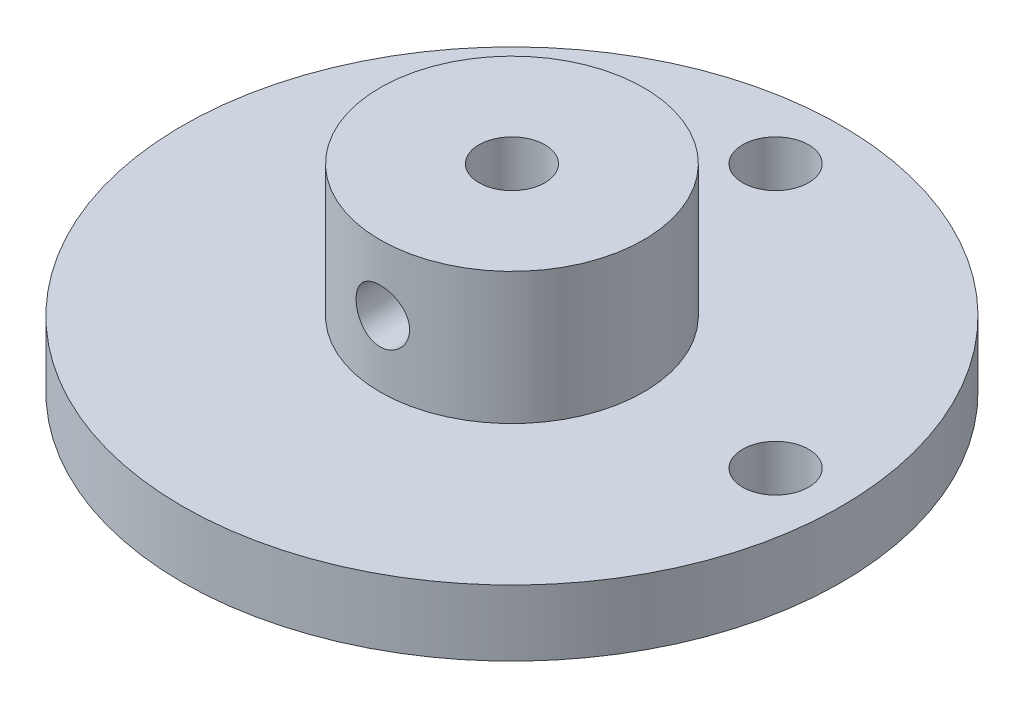
ISO-10303-21;
HEADER;
FILE_DESCRIPTION(('STEP AP214'),'2;1');
FILE_NAME('part.step','',(''),(''),'','','');
FILE_SCHEMA(('AUTOMOTIVE_DESIGN { 1 0 10303 214 1 1 1 1 }'));
ENDSEC;
DATA;
#1=APPLICATION_CONTEXT('core data for automotive mechanical design processes');
#2=APPLICATION_PROTOCOL_DEFINITION('international standard','automotive_design',2000,#1);
#3=PRODUCT_CONTEXT('',#1,'mechanical');
#4=PRODUCT('Part','Part','',(#3));
#5=PRODUCT_RELATED_PRODUCT_CATEGORY('part','',(#4));
#6=PRODUCT_DEFINITION_FORMATION('','',#4);
#7=PRODUCT_DEFINITION_CONTEXT('part definition',#1,'design');
#8=PRODUCT_DEFINITION('design','',#6,#7);
#9=PRODUCT_DEFINITION_SHAPE('','',#8);
#10=(LENGTH_UNIT() NAMED_UNIT(*) SI_UNIT(.MILLI.,.METRE.));
#11=(NAMED_UNIT(*) PLANE_ANGLE_UNIT() SI_UNIT($,.RADIAN.));
#12=(NAMED_UNIT(*) SI_UNIT($,.STERADIAN.) SOLID_ANGLE_UNIT());
#13=UNCERTAINTY_MEASURE_WITH_UNIT(LENGTH_MEASURE(1.E-05),#10,'distance_accuracy_value','');
#14=(GEOMETRIC_REPRESENTATION_CONTEXT(3) GLOBAL_UNCERTAINTY_ASSIGNED_CONTEXT((#13)) GLOBAL_UNIT_ASSIGNED_CONTEXT((#10,
#11,#12)) REPRESENTATION_CONTEXT('',''));
#15=CARTESIAN_POINT('',(0.,0.,0.));
#16=DIRECTION('',(0.,0.,1.));
#17=DIRECTION('',(1.,0.,0.));
#18=AXIS2_PLACEMENT_3D('',#15,#16,#17);
#19=CARTESIAN_POINT('',(0.,3.175,0.));
#20=DIRECTION('',(0.,1.,0.));
#21=DIRECTION('',(0.,0.,1.));
#22=AXIS2_PLACEMENT_3D('',#19,#20,#21);
#23=PLANE('',#22);
#24=CARTESIAN_POINT('',(12.7,3.175,0.));
#25=DIRECTION('',(0.,1.,0.));
#26=DIRECTION('',(0.,0.,1.));
#27=AXIS2_PLACEMENT_3D('',#24,#25,#26);
#28=CIRCLE('',#27,1.5875);
#29=CARTESIAN_POINT('',(12.7,3.175,1.58750000000001));
#30=VERTEX_POINT('',#29);
#31=EDGE_CURVE('E57',#30,#30,#28,.T.);
#32=ORIENTED_EDGE('',*,*,#31,.F.);
#33=EDGE_LOOP('',(#32));
#34=FACE_BOUND('',#33,.T.);
#35=CARTESIAN_POINT('',(0.,3.175,0.));
#36=DIRECTION('',(0.,1.,0.));
#37=DIRECTION('',(0.,0.,1.));
#38=AXIS2_PLACEMENT_3D('',#35,#36,#37);
#39=CIRCLE('',#38,15.875);
#40=CARTESIAN_POINT('',(0.,3.175,15.875));
#41=VERTEX_POINT('',#40);
#42=EDGE_CURVE('E10',#41,#41,#39,.T.);
#43=ORIENTED_EDGE('',*,*,#42,.T.);
#44=EDGE_LOOP('',(#43));
#45=FACE_BOUND('',#44,.T.);
#46=CARTESIAN_POINT('',(0.,3.175,-12.7));
#47=DIRECTION('',(0.,1.,0.));
#48=DIRECTION('',(0.,0.,1.));
#49=AXIS2_PLACEMENT_3D('',#46,#47,#48);
#50=CIRCLE('',#49,1.5875);
#51=CARTESIAN_POINT('',(0.,3.175,-11.1125));
#52=VERTEX_POINT('',#51);
#53=EDGE_CURVE('E52',#52,#52,#50,.T.);
#54=ORIENTED_EDGE('',*,*,#53,.F.);
#55=EDGE_LOOP('',(#54));
#56=FACE_BOUND('',#55,.T.);
#57=CARTESIAN_POINT('',(0.,3.175,0.));
#58=DIRECTION('',(0.,1.,0.));
#59=DIRECTION('',(0.,0.,1.));
#60=AXIS2_PLACEMENT_3D('',#57,#58,#59);
#61=CIRCLE('',#60,6.35);
#62=CARTESIAN_POINT('',(0.,3.175,6.35));
#63=VERTEX_POINT('',#62);
#64=EDGE_CURVE('E66',#63,#63,#61,.T.);
#65=ORIENTED_EDGE('',*,*,#64,.F.);
#66=EDGE_LOOP('',(#65));
#67=FACE_BOUND('',#66,.T.);
#68=ADVANCED_FACE('F35',(#34,#45,#56,#67),#23,.T.);
#69=CARTESIAN_POINT('',(0.,0.,0.));
#70=DIRECTION('',(0.,1.,0.));
#71=DIRECTION('',(0.,0.,1.));
#72=AXIS2_PLACEMENT_3D('',#69,#70,#71);
#73=PLANE('',#72);
#74=CARTESIAN_POINT('',(0.,0.,0.));
#75=DIRECTION('',(0.,1.,0.));
#76=DIRECTION('',(0.,0.,1.));
#77=AXIS2_PLACEMENT_3D('',#74,#75,#76);
#78=CIRCLE('',#77,1.5875);
#79=CARTESIAN_POINT('',(0.,0.,1.5875));
#80=VERTEX_POINT('',#79);
#81=EDGE_CURVE('E69',#80,#80,#78,.T.);
#82=ORIENTED_EDGE('',*,*,#81,.T.);
#83=EDGE_LOOP('',(#82));
#84=FACE_BOUND('',#83,.T.);
#85=CARTESIAN_POINT('',(0.,0.,-12.7));
#86=DIRECTION('',(0.,1.,0.));
#87=DIRECTION('',(0.,0.,1.));
#88=AXIS2_PLACEMENT_3D('',#85,#86,#87);
#89=CIRCLE('',#88,1.5875);
#90=CARTESIAN_POINT('',(0.,0.,-11.1125));
#91=VERTEX_POINT('',#90);
#92=EDGE_CURVE('E54',#91,#91,#89,.T.);
#93=ORIENTED_EDGE('',*,*,#92,.T.);
#94=EDGE_LOOP('',(#93));
#95=FACE_BOUND('',#94,.T.);
#96=CARTESIAN_POINT('',(0.,0.,0.));
#97=DIRECTION('',(0.,1.,0.));
#98=DIRECTION('',(0.,0.,1.));
#99=AXIS2_PLACEMENT_3D('',#96,#97,#98);
#100=CIRCLE('',#99,15.875);
#101=CARTESIAN_POINT('',(0.,0.,15.875));
#102=VERTEX_POINT('',#101);
#103=EDGE_CURVE('E47',#102,#102,#100,.T.);
#104=ORIENTED_EDGE('',*,*,#103,.F.);
#105=EDGE_LOOP('',(#104));
#106=FACE_BOUND('',#105,.T.);
#107=CARTESIAN_POINT('',(12.7,0.,0.));
#108=DIRECTION('',(0.,1.,0.));
#109=DIRECTION('',(0.,0.,1.));
#110=AXIS2_PLACEMENT_3D('',#107,#108,#109);
#111=CIRCLE('',#110,1.5875);
#112=CARTESIAN_POINT('',(12.7,0.,1.58750000000001));
#113=VERTEX_POINT('',#112);
#114=EDGE_CURVE('E60',#113,#113,#111,.T.);
#115=ORIENTED_EDGE('',*,*,#114,.T.);
#116=EDGE_LOOP('',(#115));
#117=FACE_BOUND('',#116,.T.);
#118=ADVANCED_FACE('F108',(#84,#95,#106,#117),#73,.F.);
#119=CARTESIAN_POINT('',(0.,3.175,0.));
#120=DIRECTION('',(0.,-1.,0.));
#121=DIRECTION('',(0.,0.,-1.));
#122=AXIS2_PLACEMENT_3D('',#119,#120,#121);
#123=CYLINDRICAL_SURFACE('',#122,15.875);
#124=ORIENTED_EDGE('',*,*,#42,.F.);
#125=EDGE_LOOP('',(#124));
#126=FACE_BOUND('',#125,.T.);
#127=ORIENTED_EDGE('',*,*,#103,.T.);
#128=EDGE_LOOP('',(#127));
#129=FACE_BOUND('',#128,.T.);
#130=ADVANCED_FACE('F37',(#126,#129),#123,.T.);
#131=CARTESIAN_POINT('',(0.,3.175,-12.7));
#132=DIRECTION('',(0.,-1.,0.));
#133=DIRECTION('',(0.,0.,-1.));
#134=AXIS2_PLACEMENT_3D('',#131,#132,#133);
#135=CYLINDRICAL_SURFACE('',#134,1.5875);
#136=ORIENTED_EDGE('',*,*,#53,.T.);
#137=EDGE_LOOP('',(#136));
#138=FACE_BOUND('',#137,.T.);
#139=ORIENTED_EDGE('',*,*,#92,.F.);
#140=EDGE_LOOP('',(#139));
#141=FACE_BOUND('',#140,.T.);
#142=ADVANCED_FACE('F117',(#138,#141),#135,.F.);
#143=CARTESIAN_POINT('',(12.7,3.175,0.));
#144=DIRECTION('',(0.,-1.,0.));
#145=DIRECTION('',(0.,0.,-1.));
#146=AXIS2_PLACEMENT_3D('',#143,#144,#145);
#147=CYLINDRICAL_SURFACE('',#146,1.5875);
#148=ORIENTED_EDGE('',*,*,#31,.T.);
#149=EDGE_LOOP('',(#148));
#150=FACE_BOUND('',#149,.T.);
#151=ORIENTED_EDGE('',*,*,#114,.F.);
#152=EDGE_LOOP('',(#151));
#153=FACE_BOUND('',#152,.T.);
#154=ADVANCED_FACE('F103',(#150,#153),#147,.F.);
#155=CARTESIAN_POINT('',(0.,9.525,0.));
#156=DIRECTION('',(0.,-1.,0.));
#157=DIRECTION('',(0.,0.,-1.));
#158=AXIS2_PLACEMENT_3D('',#155,#156,#157);
#159=CYLINDRICAL_SURFACE('',#158,6.35);
#160=CARTESIAN_POINT('',(-1.28905,6.35,6.21778498321549));
#161=CARTESIAN_POINT('',(-1.28904737952194,6.42160150366187,6.21778641339051));
#162=CARTESIAN_POINT('',(-1.2830639736923,6.49323577273111,6.21903523507547));
#163=CARTESIAN_POINT('',(-1.25930934791696,6.63447617922766,6.22388796989815));
#164=CARTESIAN_POINT('',(-1.24152883687684,6.70408067291346,6.22749373927363));
#165=CARTESIAN_POINT('',(-1.19475544617143,6.83919775621384,6.23663554841667));
#166=CARTESIAN_POINT('',(-1.16577389567251,6.90471440291829,6.24216963725208));
#167=CARTESIAN_POINT('',(-1.09745234847629,7.02995420754309,6.25454220903173));
#168=CARTESIAN_POINT('',(-1.05811287303627,7.08967765679624,6.26138062633154));
#169=CARTESIAN_POINT('',(-0.969581389966977,7.20250840099399,6.27570261385446));
#170=CARTESIAN_POINT('',(-0.92026734301716,7.25551903270124,6.28319344736122));
#171=CARTESIAN_POINT('',(-0.813450203849385,7.35257506292211,6.29791236529199));
#172=CARTESIAN_POINT('',(-0.75594652874443,7.39661982275799,6.3051404309678));
#173=CARTESIAN_POINT('',(-0.633741096747164,7.47487006146509,6.31859786240251));
#174=CARTESIAN_POINT('',(-0.568979266759275,7.50898350860826,6.324817663883));
#175=CARTESIAN_POINT('',(-0.4344955757306,7.56580866140436,6.33547610217282));
#176=CARTESIAN_POINT('',(-0.364774193881214,7.58852146688239,6.33991491078706));
#177=CARTESIAN_POINT('',(-0.223354008587394,7.6215992097972,6.34645991444234));
#178=CARTESIAN_POINT('',(-0.151694847740931,7.63212743484754,6.34859692859883));
#179=CARTESIAN_POINT('',(-0.00759761190573583,7.64104677660912,6.35040405229694));
#180=CARTESIAN_POINT('',(0.0648403851417759,7.63943909672472,6.35007440643423));
#181=CARTESIAN_POINT('',(0.207316450153965,7.62425576747759,6.34700918271445));
#182=CARTESIAN_POINT('',(0.277374135506261,7.6108560223873,6.34430896844471));
#183=CARTESIAN_POINT('',(0.41422543435876,7.57274814193144,6.33684594882567));
#184=CARTESIAN_POINT('',(0.481018914371296,7.5480395445249,6.33208305920294));
#185=CARTESIAN_POINT('',(0.609945506489828,7.48785353073555,6.32097178391367));
#186=CARTESIAN_POINT('',(0.67204570801619,7.45230754636443,6.31461334995907));
#187=CARTESIAN_POINT('',(0.789464875766029,7.37150657539758,6.30101135974161));
#188=CARTESIAN_POINT('',(0.844783038079518,7.32625043955277,6.29376769875106));
#189=CARTESIAN_POINT('',(0.948112119092833,7.22634994311278,6.27904137464542));
#190=CARTESIAN_POINT('',(0.995974032761278,7.17155163185794,6.27155675540496));
#191=CARTESIAN_POINT('',(1.08185362947766,7.05463047262196,6.2573151893891));
#192=CARTESIAN_POINT('',(1.11987111490792,6.99250747764107,6.25055825722294));
#193=CARTESIAN_POINT('',(1.18503633146353,6.86248226100736,6.23853305055112));
#194=CARTESIAN_POINT('',(1.212159320607,6.79456730448624,6.23326817246877));
#195=CARTESIAN_POINT('',(1.25456521573853,6.65501235921529,6.22487254247456));
#196=CARTESIAN_POINT('',(1.26984971580651,6.58337287336872,6.22174150324318));
#197=CARTESIAN_POINT('',(1.28792076915166,6.43975465044125,6.21802578311351));
#198=CARTESIAN_POINT('',(1.29092277358367,6.36780412831669,6.21739721099666));
#199=CARTESIAN_POINT('',(1.28492392692738,6.22443045269229,6.21863968958195));
#200=CARTESIAN_POINT('',(1.27592377840325,6.15300726857001,6.22051059397346));
#201=CARTESIAN_POINT('',(1.24636203668758,6.01344389476154,6.2265000658392));
#202=CARTESIAN_POINT('',(1.22591610818647,5.94527815205012,6.23059613497114));
#203=CARTESIAN_POINT('',(1.17416710566173,5.8133397911895,6.24055459670852));
#204=CARTESIAN_POINT('',(1.14286311431649,5.7495675447618,6.24641713854536));
#205=CARTESIAN_POINT('',(1.06980090589781,5.62728528051005,6.25934625440398));
#206=CARTESIAN_POINT('',(1.02790819895293,5.56885724503377,6.26642791241297));
#207=CARTESIAN_POINT('',(0.935036499986432,5.45978171703265,6.28095620180544));
#208=CARTESIAN_POINT('',(0.884056543140034,5.40913505174701,6.28840287188258));
#209=CARTESIAN_POINT('',(0.773489071103943,5.31624007079007,6.30296492966398));
#210=CARTESIAN_POINT('',(0.713777914846244,5.27413761912897,6.31007319426372));
#211=CARTESIAN_POINT('',(0.588004839196815,5.20056211543569,6.32303258631277));
#212=CARTESIAN_POINT('',(0.521943191764822,5.16908860847932,6.32888376756199));
#213=CARTESIAN_POINT('',(0.385722986183788,5.11787556292363,6.33863936523699));
#214=CARTESIAN_POINT('',(0.315590777755936,5.09806817309434,6.34255501703051));
#215=CARTESIAN_POINT('',(0.172907031399997,5.07053507791251,6.34804661929737));
#216=CARTESIAN_POINT('',(0.100355795248185,5.0628078712611,6.34962286050632));
#217=CARTESIAN_POINT('',(-0.0437146414423481,5.05971408648102,6.35025089542079));
#218=CARTESIAN_POINT('',(-0.115229032930141,5.06412844868666,6.34934742893908));
#219=CARTESIAN_POINT('',(-0.256474234708992,5.08470783825395,6.34521190492512));
#220=CARTESIAN_POINT('',(-0.32620506882,5.10087270859908,6.34197987850832));
#221=CARTESIAN_POINT('',(-0.461762144405297,5.14439567550386,6.33355197136028));
#222=CARTESIAN_POINT('',(-0.527597388400805,5.17172671053433,6.32836084087908));
#223=CARTESIAN_POINT('',(-0.653778688860839,5.23677810634556,6.31657294963047));
#224=CARTESIAN_POINT('',(-0.714124295106345,5.27449931823088,6.30997607372237));
#225=CARTESIAN_POINT('',(-0.828694260651759,5.35999544219022,6.29596347696653));
#226=CARTESIAN_POINT('',(-0.882800546310001,5.407926669311,6.28853599352778));
#227=CARTESIAN_POINT('',(-0.982277223260214,5.51216194983844,6.27376813097743));
#228=CARTESIAN_POINT('',(-1.02764553791871,5.56846798795041,6.26642777295973));
#229=CARTESIAN_POINT('',(-1.10884060128915,5.68860885049522,6.25257487489562));
#230=CARTESIAN_POINT('',(-1.14455520338195,5.75252069083495,6.24607248866456));
#231=CARTESIAN_POINT('',(-1.20468141325684,5.88555325579153,6.23475630364507));
#232=CARTESIAN_POINT('',(-1.2291031694333,5.95466923845143,6.22994098970429));
#233=CARTESIAN_POINT('',(-1.2612723346383,6.07827410895847,6.22349451104379));
#234=CARTESIAN_POINT('',(-1.27167011818868,6.13206303445819,6.22136685067924));
#235=CARTESIAN_POINT('',(-1.2855598264532,6.24056161484444,6.21851156571037));
#236=CARTESIAN_POINT('',(-1.28905200296806,6.29527123608606,6.21778389005812));
#237=CARTESIAN_POINT('',(-1.28905,6.35,6.21778498321549));
#238=B_SPLINE_CURVE_WITH_KNOTS('',3,(#160,#161,#162,#163,#164,#165,#166,#167,#168,#169,#170,
#171,#172,#173,#174,#175,#176,#177,#178,#179,#180,#181,#182,#183,#184,#185,#186,#187,#188,#189,
#190,#191,#192,#193,#194,#195,#196,#197,#198,#199,#200,#201,#202,#203,#204,#205,#206,#207,#208,
#209,#210,#211,#212,#213,#214,#215,#216,#217,#218,#219,#220,#221,#222,#223,#224,#225,#226,#227,
#228,#229,#230,#231,#232,#233,#234,#235,#236,#237),.UNSPECIFIED.,.T.,.F.,(4,2,2,2,2,2,2,2,2,2,2,
2,2,2,2,2,2,2,2,2,2,2,2,2,2,2,2,2,2,2,2,2,2,2,2,2,2,2,4),(0.,0.214604094989305,
0.429377407549749,0.643934056141882,0.858479909343259,1.07582955802195,1.29319468404021,
1.51251426787693,1.73181268978524,1.94813692397771,2.16443970759774,2.37756954229465,
2.59070808552401,2.80522416760419,3.01976565284461,3.23815853538839,3.45655580162503,
3.6754462927958,3.89430730472935,4.10931230359297,4.32430471736668,4.53716276764572,
4.75003880519093,4.96576791722499,5.18151994762344,5.4006922210937,5.61985511269083,
5.83773041277991,6.05557863364775,6.26952231827644,6.48346314412879,6.69688852507115,
6.9103313938162,7.1273130028259,7.34434611541391,7.56380157086573,7.78305942603147,
7.94709851087814,8.11113161422049),.UNSPECIFIED.);
#239=CARTESIAN_POINT('',(-1.28905,6.35,6.21778498321549));
#240=VERTEX_POINT('',#239);
#241=EDGE_CURVE('E75',#240,#240,#238,.T.);
#242=ORIENTED_EDGE('',*,*,#241,.T.);
#243=EDGE_LOOP('',(#242));
#244=FACE_BOUND('',#243,.T.);
#245=CARTESIAN_POINT('',(0.,9.525,0.));
#246=DIRECTION('',(0.,1.,0.));
#247=DIRECTION('',(0.,0.,1.));
#248=AXIS2_PLACEMENT_3D('',#245,#246,#247);
#249=CIRCLE('',#248,6.35);
#250=CARTESIAN_POINT('',(0.,9.525,6.35));
#251=VERTEX_POINT('',#250);
#252=EDGE_CURVE('E63',#251,#251,#249,.T.);
#253=ORIENTED_EDGE('',*,*,#252,.F.);
#254=EDGE_LOOP('',(#253));
#255=FACE_BOUND('',#254,.T.);
#256=ORIENTED_EDGE('',*,*,#64,.T.);
#257=EDGE_LOOP('',(#256));
#258=FACE_BOUND('',#257,.T.);
#259=ADVANCED_FACE('F82',(#244,#255,#258),#159,.T.);
#260=CARTESIAN_POINT('',(0.,9.525,0.));
#261=DIRECTION('',(0.,1.,0.));
#262=DIRECTION('',(0.,0.,1.));
#263=AXIS2_PLACEMENT_3D('',#260,#261,#262);
#264=PLANE('',#263);
#265=CARTESIAN_POINT('',(0.,9.525,0.));
#266=DIRECTION('',(0.,1.,0.));
#267=DIRECTION('',(0.,0.,1.));
#268=AXIS2_PLACEMENT_3D('',#265,#266,#267);
#269=CIRCLE('',#268,1.5875);
#270=CARTESIAN_POINT('',(0.,9.525,1.5875));
#271=VERTEX_POINT('',#270);
#272=EDGE_CURVE('E72',#271,#271,#269,.T.);
#273=ORIENTED_EDGE('',*,*,#272,.F.);
#274=EDGE_LOOP('',(#273));
#275=FACE_BOUND('',#274,.T.);
#276=ORIENTED_EDGE('',*,*,#252,.T.);
#277=EDGE_LOOP('',(#276));
#278=FACE_BOUND('',#277,.T.);
#279=ADVANCED_FACE('F94',(#275,#278),#264,.T.);
#280=CARTESIAN_POINT('',(0.,0.,0.));
#281=DIRECTION('',(0.,1.,0.));
#282=DIRECTION('',(0.,0.,1.));
#283=AXIS2_PLACEMENT_3D('',#280,#281,#282);
#284=CYLINDRICAL_SURFACE('',#283,1.5875);
#285=CARTESIAN_POINT('',(0.,5.06095,1.5875));
#286=CARTESIAN_POINT('',(0.0616480769503704,5.06095519438625,1.58749494349317));
#287=CARTESIAN_POINT('',(0.12335792646526,5.06540763989123,1.58387381329494));
#288=CARTESIAN_POINT('',(0.244764899202939,5.08290953493104,1.56971313415214));
#289=CARTESIAN_POINT('',(0.304458670119981,5.09597262714538,1.5591626063893));
#290=CARTESIAN_POINT('',(0.41976939530008,5.12974092299982,1.53213466553945));
#291=CARTESIAN_POINT('',(0.475409131791544,5.15039870925628,1.51569404310013));
#292=CARTESIAN_POINT('',(0.581979284139879,5.19831880032004,1.47805857533639));
#293=CARTESIAN_POINT('',(0.632908942743183,5.22558216458456,1.45686296740852));
#294=CARTESIAN_POINT('',(0.746747093789388,5.29644643423213,1.40277564698295));
#295=CARTESIAN_POINT('',(0.807481290716842,5.34241025342599,1.36840415624215));
#296=CARTESIAN_POINT('',(0.919049719758385,5.44299046884592,1.29612502138797));
#297=CARTESIAN_POINT('',(0.969854863293663,5.49763146292537,1.25820745449569));
#298=CARTESIAN_POINT('',(1.06207926197714,5.61559657341351,1.18143789581193));
#299=CARTESIAN_POINT('',(1.10332725552679,5.67905067453216,1.14258088442277));
#300=CARTESIAN_POINT('',(1.17479503405599,5.81398679646167,1.06893082022642));
#301=CARTESIAN_POINT('',(1.20505029569288,5.88544200086765,1.03412494495274));
#302=CARTESIAN_POINT('',(1.24249800290099,6.0038096799432,0.988344283071656));
#303=CARTESIAN_POINT('',(1.25399745661509,6.04787407423255,0.973589638833806));
#304=CARTESIAN_POINT('',(1.27238672203528,6.13833352959976,0.949430897117386));
#305=CARTESIAN_POINT('',(1.27928802669179,6.18472246578665,0.940013468290088));
#306=CARTESIAN_POINT('',(1.28799672012199,6.27937776488317,0.928053494452627));
#307=CARTESIAN_POINT('',(1.28975317797138,6.32765813555728,0.9255796972178));
#308=CARTESIAN_POINT('',(1.28783105212339,6.42390882497578,0.928249996733428));
#309=CARTESIAN_POINT('',(1.28414908283735,6.47187893189533,0.933398838816617));
#310=CARTESIAN_POINT('',(1.27089526456826,6.57219916293958,0.951375316970486));
#311=CARTESIAN_POINT('',(1.26060173820133,6.62427736524494,0.965137592087124));
#312=CARTESIAN_POINT('',(1.23437818785195,6.72508760314194,0.998456091512972));
#313=CARTESIAN_POINT('',(1.21843079624431,6.77380876948836,1.01803013805167));
#314=CARTESIAN_POINT('',(1.17186333061781,6.8925300264132,1.07178511006353));
#315=CARTESIAN_POINT('',(1.13794103048213,6.96019564703811,1.10822413527864));
#316=CARTESIAN_POINT('',(1.05966218546149,7.08781760118986,1.18331796230241));
#317=CARTESIAN_POINT('',(1.01528912782891,7.14776149970143,1.22197619671285));
#318=CARTESIAN_POINT('',(0.914637190880287,7.26162150215937,1.29913751129024));
#319=CARTESIAN_POINT('',(0.858002045516834,7.31526021397712,1.33758975669674));
#320=CARTESIAN_POINT('',(0.734033884545957,7.41255174823403,1.4094171046869));
#321=CARTESIAN_POINT('',(0.666728796900809,7.45622993346887,1.44280502835725));
#322=CARTESIAN_POINT('',(0.542377439211764,7.52086749308047,1.49303408884011));
#323=CARTESIAN_POINT('',(0.487675855362576,7.5447673571918,1.51189524810748));
#324=CARTESIAN_POINT('',(0.37399213823003,7.58507376750859,1.5439439628328));
#325=CARTESIAN_POINT('',(0.315013182474689,7.60148581142361,1.55713568049568));
#326=CARTESIAN_POINT('',(0.193846530073123,7.62589652932945,1.57682138396028));
#327=CARTESIAN_POINT('',(0.131641857731784,7.63384465993297,1.58327512862671));
#328=CARTESIAN_POINT('',(0.0064135085977003,7.6405563050775,1.58872198976318));
#329=CARTESIAN_POINT('',(-0.0566099174003507,7.63932256887347,1.58771733944265));
#330=CARTESIAN_POINT('',(-0.175379019367851,7.6283249348703,1.57880105681032));
#331=CARTESIAN_POINT('',(-0.231253393455209,7.61937095346196,1.57154527408783));
#332=CARTESIAN_POINT('',(-0.340407568837286,7.59455095358706,1.55156675476591));
#333=CARTESIAN_POINT('',(-0.393687036777766,7.57868404964323,1.53884331781671));
#334=CARTESIAN_POINT('',(-0.499003487717336,7.53993332347721,1.5080789091089));
#335=CARTESIAN_POINT('',(-0.550866994577566,7.51675707874444,1.48981785196132));
#336=CARTESIAN_POINT('',(-0.649922465515173,7.46462502181861,1.44935374572233));
#337=CARTESIAN_POINT('',(-0.697111369866605,7.43566546110838,1.42714814096766));
#338=CARTESIAN_POINT('',(-0.806601919007723,7.35862500140766,1.36927539304877));
#339=CARTESIAN_POINT('',(-0.8661554675654,7.30780205534372,1.33204554226699));
#340=CARTESIAN_POINT('',(-0.974538764688097,7.19731413312487,1.25493527726475));
#341=CARTESIAN_POINT('',(-1.02334306423506,7.13762872204428,1.21504885800212));
#342=CARTESIAN_POINT('',(-1.1037100076288,7.01920565879932,1.14214040449987));
#343=CARTESIAN_POINT('',(-1.13674162522424,6.96155999340507,1.10895438010901));
#344=CARTESIAN_POINT('',(-1.19416010934513,6.84002831266864,1.04685687980488));
#345=CARTESIAN_POINT('',(-1.21857248156526,6.77616143484628,1.01793294226374));
#346=CARTESIAN_POINT('',(-1.25041066662915,6.66638104846217,0.978279360259287));
#347=CARTESIAN_POINT('',(-1.26078611093992,6.62235425335017,0.96475529633245));
#348=CARTESIAN_POINT('',(-1.27692965246329,6.53217666027297,0.943286551401139));
#349=CARTESIAN_POINT('',(-1.28270851081934,6.48603109234077,0.935328844210168));
#350=CARTESIAN_POINT('',(-1.28921693616716,6.39229206840927,0.926343680187052));
#351=CARTESIAN_POINT('',(-1.28990515586275,6.34468990275538,0.925372975039987));
#352=CARTESIAN_POINT('',(-1.2860470886514,6.25009766352051,0.930723743088452));
#353=CARTESIAN_POINT('',(-1.28149535147588,6.20310827876746,0.937052809052787));
#354=CARTESIAN_POINT('',(-1.26625470266458,6.10236663952874,0.95757046316827));
#355=CARTESIAN_POINT('',(-1.25455931598432,6.04903772779673,0.973029733532649));
#356=CARTESIAN_POINT('',(-1.22529582012946,5.94603801846664,1.00963097730651));
#357=CARTESIAN_POINT('',(-1.20770956175715,5.89637911213325,1.03079047261663));
#358=CARTESIAN_POINT('',(-1.15692983049329,5.77609674010436,1.08801601403178));
#359=CARTESIAN_POINT('',(-1.12036617376312,5.70788577685352,1.12613811293273));
#360=CARTESIAN_POINT('',(-1.0363183831914,5.5795593304521,1.20395561851776));
#361=CARTESIAN_POINT('',(-0.988818692535642,5.51945557505128,1.24365319914749));
#362=CARTESIAN_POINT('',(-0.881715265811096,5.4063668690901,1.32183521993407));
#363=CARTESIAN_POINT('',(-0.821833054830791,5.35360327630913,1.36026267444628));
#364=CARTESIAN_POINT('',(-0.691050114833312,5.25886604602182,1.43111864563258));
#365=CARTESIAN_POINT('',(-0.62017994950842,5.21686331107801,1.46356327180916));
#366=CARTESIAN_POINT('',(-0.491851513581244,5.15706022444481,1.51042529871094));
#367=CARTESIAN_POINT('',(-0.436908308695999,5.13578607619498,1.52732206766054));
#368=CARTESIAN_POINT('',(-0.323319817136792,5.10075032761728,1.55531937924669));
#369=CARTESIAN_POINT('',(-0.264683010472835,5.08697217194026,1.56643269261155));
#370=CARTESIAN_POINT('',(-0.171292524769334,5.07192370428508,1.5785995085863));
#371=CARTESIAN_POINT('',(-0.137260136448606,5.06781937021825,1.58192632343396));
#372=CARTESIAN_POINT('',(-0.0688249792576212,5.06233072455037,1.58637825874508));
#373=CARTESIAN_POINT('',(-0.0344221190852733,5.06094709963732,1.58750282337566));
#374=CARTESIAN_POINT('',(0.,5.06095,1.5875));
#375=B_SPLINE_CURVE_WITH_KNOTS('',3,(#285,#286,#287,#288,#289,#290,#291,#292,#293,#294,#295,
#296,#297,#298,#299,#300,#301,#302,#303,#304,#305,#306,#307,#308,#309,#310,#311,#312,#313,#314,
#315,#316,#317,#318,#319,#320,#321,#322,#323,#324,#325,#326,#327,#328,#329,#330,#331,#332,#333,
#334,#335,#336,#337,#338,#339,#340,#341,#342,#343,#344,#345,#346,#347,#348,#349,#350,#351,#352,
#353,#354,#355,#356,#357,#358,#359,#360,#361,#362,#363,#364,#365,#366,#367,#368,#369,#370,#371,
#372,#373,#374),.UNSPECIFIED.,.T.,.F.,(4,2,2,2,2,2,2,2,2,2,2,2,2,2,2,2,2,2,2,2,2,2,2,2,2,2,2,2,
2,2,2,2,2,2,2,2,2,2,2,2,2,2,2,2,4),(0.,0.184796286507457,0.36988606967378,0.553839345916651,
0.737822145660745,0.987182485985577,1.23726275819369,1.49152722722659,1.74496366694137,
1.88813466772909,2.03094646038292,2.17516730494109,2.3194779692728,2.48308350514894,
2.6471960245198,2.89788952011642,3.14898181398209,3.4086894304013,3.66772817162206,
3.85480155035951,4.04173735410624,4.22978331535146,4.41777297372262,4.58815211161505,
4.75855307981547,4.93689135038932,5.11534559016749,5.37405905410986,5.63337859497305,
5.85550288050254,6.07696424515574,6.2181278790059,6.35896005155939,6.50093485101905,
6.64305745712956,6.81233603650559,6.98214101826058,7.23961151578261,7.49745056035398,
7.76188337415537,8.02559342770293,8.20875709652068,8.39151457803545,8.49467229542254,
8.59785604575748),.UNSPECIFIED.);
#376=CARTESIAN_POINT('',(0.,5.06095,1.5875));
#377=VERTEX_POINT('',#376);
#378=EDGE_CURVE('E39',#377,#377,#375,.T.);
#379=ORIENTED_EDGE('',*,*,#378,.T.);
#380=EDGE_LOOP('',(#379));
#381=FACE_BOUND('',#380,.T.);
#382=ORIENTED_EDGE('',*,*,#81,.F.);
#383=EDGE_LOOP('',(#382));
#384=FACE_BOUND('',#383,.T.);
#385=ORIENTED_EDGE('',*,*,#272,.T.);
#386=EDGE_LOOP('',(#385));
#387=FACE_BOUND('',#386,.T.);
#388=ADVANCED_FACE('F89',(#381,#384,#387),#284,.F.);
#389=CARTESIAN_POINT('',(0.,6.35,0.));
#390=DIRECTION('',(0.,0.,-1.));
#391=DIRECTION('',(-1.,0.,0.));
#392=AXIS2_PLACEMENT_3D('',#389,#390,#391);
#393=CYLINDRICAL_SURFACE('',#392,1.28905);
#394=ORIENTED_EDGE('',*,*,#378,.F.);
#395=EDGE_LOOP('',(#394));
#396=FACE_BOUND('',#395,.T.);
#397=ORIENTED_EDGE('',*,*,#241,.F.);
#398=EDGE_LOOP('',(#397));
#399=FACE_BOUND('',#398,.T.);
#400=ADVANCED_FACE('F86',(#396,#399),#393,.F.);
#401=CLOSED_SHELL('',(#68,#118,#130,#142,#154,#259,#279,#388,#400));
#402=MANIFOLD_SOLID_BREP('B2',#401);
#403=ADVANCED_BREP_SHAPE_REPRESENTATION('',(#18,#402),#14);
#404=SHAPE_DEFINITION_REPRESENTATION(#9,#403);
ENDSEC;
END-ISO-10303-21;
